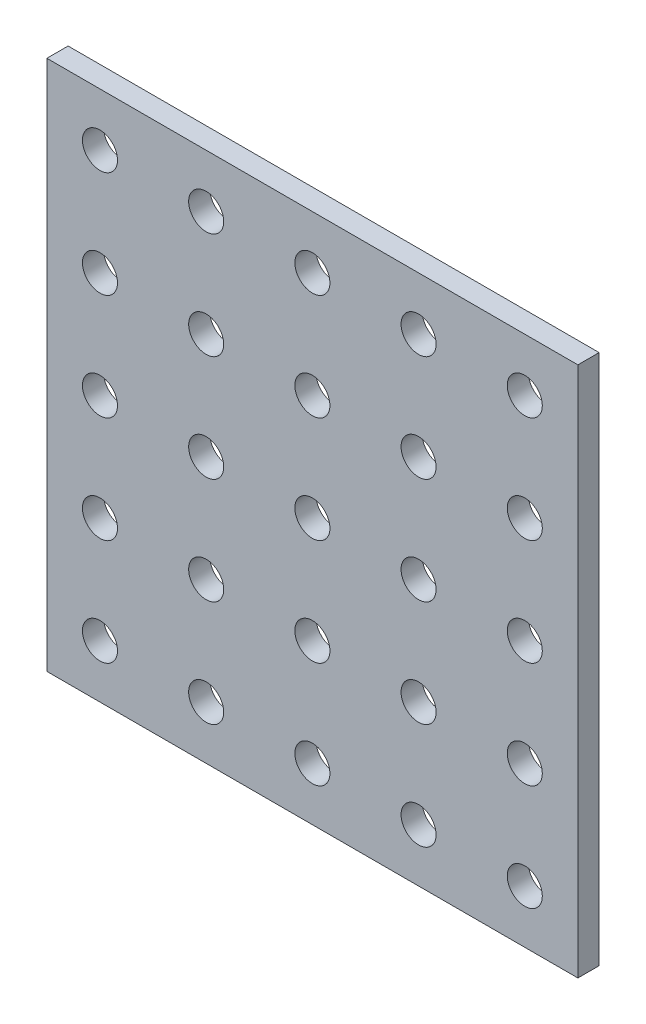
ISO-10303-21;
HEADER;
FILE_DESCRIPTION(('STEP AP214'),'2;1');
FILE_NAME('part.step','',(''),(''),'','','');
FILE_SCHEMA(('AUTOMOTIVE_DESIGN { 1 0 10303 214 1 1 1 1 }'));
ENDSEC;
DATA;
#1=APPLICATION_CONTEXT('core data for automotive mechanical design processes');
#2=APPLICATION_PROTOCOL_DEFINITION('international standard','automotive_design',2000,#1);
#3=PRODUCT_CONTEXT('',#1,'mechanical');
#4=PRODUCT('Part','Part','',(#3));
#5=PRODUCT_RELATED_PRODUCT_CATEGORY('part','',(#4));
#6=PRODUCT_DEFINITION_FORMATION('','',#4);
#7=PRODUCT_DEFINITION_CONTEXT('part definition',#1,'design');
#8=PRODUCT_DEFINITION('design','',#6,#7);
#9=PRODUCT_DEFINITION_SHAPE('','',#8);
#10=(LENGTH_UNIT() NAMED_UNIT(*) SI_UNIT(.MILLI.,.METRE.));
#11=(NAMED_UNIT(*) PLANE_ANGLE_UNIT() SI_UNIT($,.RADIAN.));
#12=(NAMED_UNIT(*) SI_UNIT($,.STERADIAN.) SOLID_ANGLE_UNIT());
#13=UNCERTAINTY_MEASURE_WITH_UNIT(LENGTH_MEASURE(1.E-05),#10,'distance_accuracy_value','');
#14=(GEOMETRIC_REPRESENTATION_CONTEXT(3) GLOBAL_UNCERTAINTY_ASSIGNED_CONTEXT((#13)) GLOBAL_UNIT_ASSIGNED_CONTEXT((#10,
#11,#12)) REPRESENTATION_CONTEXT('',''));
#15=CARTESIAN_POINT('',(0.,0.,0.));
#16=DIRECTION('',(0.,0.,1.));
#17=DIRECTION('',(1.,0.,0.));
#18=AXIS2_PLACEMENT_3D('',#15,#16,#17);
#19=CARTESIAN_POINT('',(20.,-20.,0.));
#20=DIRECTION('',(0.,0.,1.));
#21=DIRECTION('',(1.,0.,0.));
#22=AXIS2_PLACEMENT_3D('',#19,#20,#21);
#23=CYLINDRICAL_SURFACE('',#22,1.65);
#24=CARTESIAN_POINT('',(20.,-20.,0.));
#25=DIRECTION('',(0.,0.,1.));
#26=DIRECTION('',(1.,0.,0.));
#27=AXIS2_PLACEMENT_3D('',#24,#25,#26);
#28=CIRCLE('',#27,1.65);
#29=CARTESIAN_POINT('',(21.65,-20.,0.));
#30=VERTEX_POINT('',#29);
#31=EDGE_CURVE('E41',#30,#30,#28,.T.);
#32=ORIENTED_EDGE('',*,*,#31,.F.);
#33=EDGE_LOOP('',(#32));
#34=FACE_BOUND('',#33,.T.);
#35=CARTESIAN_POINT('',(20.,-20.,2.));
#36=DIRECTION('',(0.,0.,1.));
#37=DIRECTION('',(1.,0.,0.));
#38=AXIS2_PLACEMENT_3D('',#35,#36,#37);
#39=CIRCLE('',#38,1.65);
#40=CARTESIAN_POINT('',(21.65,-20.,2.));
#41=VERTEX_POINT('',#40);
#42=EDGE_CURVE('E11',#41,#41,#39,.T.);
#43=ORIENTED_EDGE('',*,*,#42,.T.);
#44=EDGE_LOOP('',(#43));
#45=FACE_BOUND('',#44,.T.);
#46=ADVANCED_FACE('F33',(#34,#45),#23,.F.);
#47=CARTESIAN_POINT('',(20.,-9.99999999999999,0.));
#48=DIRECTION('',(0.,0.,1.));
#49=DIRECTION('',(1.,0.,0.));
#50=AXIS2_PLACEMENT_3D('',#47,#48,#49);
#51=CYLINDRICAL_SURFACE('',#50,1.65);
#52=CARTESIAN_POINT('',(20.,-9.99999999999999,0.));
#53=DIRECTION('',(0.,0.,1.));
#54=DIRECTION('',(1.,0.,0.));
#55=AXIS2_PLACEMENT_3D('',#52,#53,#54);
#56=CIRCLE('',#55,1.65);
#57=CARTESIAN_POINT('',(21.65,-9.99999999999999,0.));
#58=VERTEX_POINT('',#57);
#59=EDGE_CURVE('E237',#58,#58,#56,.T.);
#60=ORIENTED_EDGE('',*,*,#59,.F.);
#61=EDGE_LOOP('',(#60));
#62=FACE_BOUND('',#61,.T.);
#63=CARTESIAN_POINT('',(20.,-9.99999999999999,2.));
#64=DIRECTION('',(0.,0.,1.));
#65=DIRECTION('',(1.,0.,0.));
#66=AXIS2_PLACEMENT_3D('',#63,#64,#65);
#67=CIRCLE('',#66,1.65);
#68=CARTESIAN_POINT('',(21.65,-9.99999999999999,2.));
#69=VERTEX_POINT('',#68);
#70=EDGE_CURVE('E240',#69,#69,#67,.T.);
#71=ORIENTED_EDGE('',*,*,#70,.T.);
#72=EDGE_LOOP('',(#71));
#73=FACE_BOUND('',#72,.T.);
#74=ADVANCED_FACE('F249',(#62,#73),#51,.F.);
#75=CARTESIAN_POINT('',(20.,0.,0.));
#76=DIRECTION('',(0.,0.,1.));
#77=DIRECTION('',(1.,0.,0.));
#78=AXIS2_PLACEMENT_3D('',#75,#76,#77);
#79=CYLINDRICAL_SURFACE('',#78,1.65);
#80=CARTESIAN_POINT('',(20.,0.,0.));
#81=DIRECTION('',(0.,0.,1.));
#82=DIRECTION('',(1.,0.,0.));
#83=AXIS2_PLACEMENT_3D('',#80,#81,#82);
#84=CIRCLE('',#83,1.65);
#85=CARTESIAN_POINT('',(21.65,0.,0.));
#86=VERTEX_POINT('',#85);
#87=EDGE_CURVE('E231',#86,#86,#84,.T.);
#88=ORIENTED_EDGE('',*,*,#87,.F.);
#89=EDGE_LOOP('',(#88));
#90=FACE_BOUND('',#89,.T.);
#91=CARTESIAN_POINT('',(20.,0.,2.));
#92=DIRECTION('',(0.,0.,1.));
#93=DIRECTION('',(1.,0.,0.));
#94=AXIS2_PLACEMENT_3D('',#91,#92,#93);
#95=CIRCLE('',#94,1.65);
#96=CARTESIAN_POINT('',(21.65,0.,2.));
#97=VERTEX_POINT('',#96);
#98=EDGE_CURVE('E234',#97,#97,#95,.T.);
#99=ORIENTED_EDGE('',*,*,#98,.T.);
#100=EDGE_LOOP('',(#99));
#101=FACE_BOUND('',#100,.T.);
#102=ADVANCED_FACE('F356',(#90,#101),#79,.F.);
#103=CARTESIAN_POINT('',(20.,10.,0.));
#104=DIRECTION('',(0.,0.,1.));
#105=DIRECTION('',(1.,0.,0.));
#106=AXIS2_PLACEMENT_3D('',#103,#104,#105);
#107=CYLINDRICAL_SURFACE('',#106,1.65);
#108=CARTESIAN_POINT('',(20.,10.,0.));
#109=DIRECTION('',(0.,0.,1.));
#110=DIRECTION('',(1.,0.,0.));
#111=AXIS2_PLACEMENT_3D('',#108,#109,#110);
#112=CIRCLE('',#111,1.65);
#113=CARTESIAN_POINT('',(21.65,10.,0.));
#114=VERTEX_POINT('',#113);
#115=EDGE_CURVE('E225',#114,#114,#112,.T.);
#116=ORIENTED_EDGE('',*,*,#115,.F.);
#117=EDGE_LOOP('',(#116));
#118=FACE_BOUND('',#117,.T.);
#119=CARTESIAN_POINT('',(20.,10.,2.));
#120=DIRECTION('',(0.,0.,1.));
#121=DIRECTION('',(1.,0.,0.));
#122=AXIS2_PLACEMENT_3D('',#119,#120,#121);
#123=CIRCLE('',#122,1.65);
#124=CARTESIAN_POINT('',(21.65,10.,2.));
#125=VERTEX_POINT('',#124);
#126=EDGE_CURVE('E228',#125,#125,#123,.T.);
#127=ORIENTED_EDGE('',*,*,#126,.T.);
#128=EDGE_LOOP('',(#127));
#129=FACE_BOUND('',#128,.T.);
#130=ADVANCED_FACE('F352',(#118,#129),#107,.F.);
#131=CARTESIAN_POINT('',(20.,20.,0.));
#132=DIRECTION('',(0.,0.,1.));
#133=DIRECTION('',(1.,0.,0.));
#134=AXIS2_PLACEMENT_3D('',#131,#132,#133);
#135=CYLINDRICAL_SURFACE('',#134,1.65);
#136=CARTESIAN_POINT('',(20.,20.,0.));
#137=DIRECTION('',(0.,0.,1.));
#138=DIRECTION('',(1.,0.,0.));
#139=AXIS2_PLACEMENT_3D('',#136,#137,#138);
#140=CIRCLE('',#139,1.65);
#141=CARTESIAN_POINT('',(21.65,20.,0.));
#142=VERTEX_POINT('',#141);
#143=EDGE_CURVE('E219',#142,#142,#140,.T.);
#144=ORIENTED_EDGE('',*,*,#143,.F.);
#145=EDGE_LOOP('',(#144));
#146=FACE_BOUND('',#145,.T.);
#147=CARTESIAN_POINT('',(20.,20.,2.));
#148=DIRECTION('',(0.,0.,1.));
#149=DIRECTION('',(1.,0.,0.));
#150=AXIS2_PLACEMENT_3D('',#147,#148,#149);
#151=CIRCLE('',#150,1.65);
#152=CARTESIAN_POINT('',(21.65,20.,2.));
#153=VERTEX_POINT('',#152);
#154=EDGE_CURVE('E222',#153,#153,#151,.T.);
#155=ORIENTED_EDGE('',*,*,#154,.T.);
#156=EDGE_LOOP('',(#155));
#157=FACE_BOUND('',#156,.T.);
#158=ADVANCED_FACE('F348',(#146,#157),#135,.F.);
#159=CARTESIAN_POINT('',(10.,-20.,0.));
#160=DIRECTION('',(0.,0.,1.));
#161=DIRECTION('',(1.,0.,0.));
#162=AXIS2_PLACEMENT_3D('',#159,#160,#161);
#163=CYLINDRICAL_SURFACE('',#162,1.65);
#164=CARTESIAN_POINT('',(10.,-20.,0.));
#165=DIRECTION('',(0.,0.,1.));
#166=DIRECTION('',(1.,0.,0.));
#167=AXIS2_PLACEMENT_3D('',#164,#165,#166);
#168=CIRCLE('',#167,1.65);
#169=CARTESIAN_POINT('',(11.65,-20.,0.));
#170=VERTEX_POINT('',#169);
#171=EDGE_CURVE('E213',#170,#170,#168,.T.);
#172=ORIENTED_EDGE('',*,*,#171,.F.);
#173=EDGE_LOOP('',(#172));
#174=FACE_BOUND('',#173,.T.);
#175=CARTESIAN_POINT('',(10.,-20.,2.));
#176=DIRECTION('',(0.,0.,1.));
#177=DIRECTION('',(1.,0.,0.));
#178=AXIS2_PLACEMENT_3D('',#175,#176,#177);
#179=CIRCLE('',#178,1.65);
#180=CARTESIAN_POINT('',(11.65,-20.,2.));
#181=VERTEX_POINT('',#180);
#182=EDGE_CURVE('E216',#181,#181,#179,.T.);
#183=ORIENTED_EDGE('',*,*,#182,.T.);
#184=EDGE_LOOP('',(#183));
#185=FACE_BOUND('',#184,.T.);
#186=ADVANCED_FACE('F344',(#174,#185),#163,.F.);
#187=CARTESIAN_POINT('',(10.,-9.99999999999999,0.));
#188=DIRECTION('',(0.,0.,1.));
#189=DIRECTION('',(1.,0.,0.));
#190=AXIS2_PLACEMENT_3D('',#187,#188,#189);
#191=CYLINDRICAL_SURFACE('',#190,1.65);
#192=CARTESIAN_POINT('',(10.,-9.99999999999999,0.));
#193=DIRECTION('',(0.,0.,1.));
#194=DIRECTION('',(1.,0.,0.));
#195=AXIS2_PLACEMENT_3D('',#192,#193,#194);
#196=CIRCLE('',#195,1.65);
#197=CARTESIAN_POINT('',(11.65,-9.99999999999999,0.));
#198=VERTEX_POINT('',#197);
#199=EDGE_CURVE('E207',#198,#198,#196,.T.);
#200=ORIENTED_EDGE('',*,*,#199,.F.);
#201=EDGE_LOOP('',(#200));
#202=FACE_BOUND('',#201,.T.);
#203=CARTESIAN_POINT('',(10.,-9.99999999999999,2.));
#204=DIRECTION('',(0.,0.,1.));
#205=DIRECTION('',(1.,0.,0.));
#206=AXIS2_PLACEMENT_3D('',#203,#204,#205);
#207=CIRCLE('',#206,1.65);
#208=CARTESIAN_POINT('',(11.65,-9.99999999999999,2.));
#209=VERTEX_POINT('',#208);
#210=EDGE_CURVE('E210',#209,#209,#207,.T.);
#211=ORIENTED_EDGE('',*,*,#210,.T.);
#212=EDGE_LOOP('',(#211));
#213=FACE_BOUND('',#212,.T.);
#214=ADVANCED_FACE('F340',(#202,#213),#191,.F.);
#215=CARTESIAN_POINT('',(10.,0.,0.));
#216=DIRECTION('',(0.,0.,1.));
#217=DIRECTION('',(1.,0.,0.));
#218=AXIS2_PLACEMENT_3D('',#215,#216,#217);
#219=CYLINDRICAL_SURFACE('',#218,1.65);
#220=CARTESIAN_POINT('',(10.,0.,0.));
#221=DIRECTION('',(0.,0.,1.));
#222=DIRECTION('',(1.,0.,0.));
#223=AXIS2_PLACEMENT_3D('',#220,#221,#222);
#224=CIRCLE('',#223,1.65);
#225=CARTESIAN_POINT('',(11.65,0.,0.));
#226=VERTEX_POINT('',#225);
#227=EDGE_CURVE('E201',#226,#226,#224,.T.);
#228=ORIENTED_EDGE('',*,*,#227,.F.);
#229=EDGE_LOOP('',(#228));
#230=FACE_BOUND('',#229,.T.);
#231=CARTESIAN_POINT('',(10.,0.,2.));
#232=DIRECTION('',(0.,0.,1.));
#233=DIRECTION('',(1.,0.,0.));
#234=AXIS2_PLACEMENT_3D('',#231,#232,#233);
#235=CIRCLE('',#234,1.65);
#236=CARTESIAN_POINT('',(11.65,0.,2.));
#237=VERTEX_POINT('',#236);
#238=EDGE_CURVE('E204',#237,#237,#235,.T.);
#239=ORIENTED_EDGE('',*,*,#238,.T.);
#240=EDGE_LOOP('',(#239));
#241=FACE_BOUND('',#240,.T.);
#242=ADVANCED_FACE('F336',(#230,#241),#219,.F.);
#243=CARTESIAN_POINT('',(10.,10.,0.));
#244=DIRECTION('',(0.,0.,1.));
#245=DIRECTION('',(1.,0.,0.));
#246=AXIS2_PLACEMENT_3D('',#243,#244,#245);
#247=CYLINDRICAL_SURFACE('',#246,1.65);
#248=CARTESIAN_POINT('',(10.,10.,0.));
#249=DIRECTION('',(0.,0.,1.));
#250=DIRECTION('',(1.,0.,0.));
#251=AXIS2_PLACEMENT_3D('',#248,#249,#250);
#252=CIRCLE('',#251,1.65);
#253=CARTESIAN_POINT('',(11.65,10.,0.));
#254=VERTEX_POINT('',#253);
#255=EDGE_CURVE('E195',#254,#254,#252,.T.);
#256=ORIENTED_EDGE('',*,*,#255,.F.);
#257=EDGE_LOOP('',(#256));
#258=FACE_BOUND('',#257,.T.);
#259=CARTESIAN_POINT('',(10.,10.,2.));
#260=DIRECTION('',(0.,0.,1.));
#261=DIRECTION('',(1.,0.,0.));
#262=AXIS2_PLACEMENT_3D('',#259,#260,#261);
#263=CIRCLE('',#262,1.65);
#264=CARTESIAN_POINT('',(11.65,10.,2.));
#265=VERTEX_POINT('',#264);
#266=EDGE_CURVE('E198',#265,#265,#263,.T.);
#267=ORIENTED_EDGE('',*,*,#266,.T.);
#268=EDGE_LOOP('',(#267));
#269=FACE_BOUND('',#268,.T.);
#270=ADVANCED_FACE('F332',(#258,#269),#247,.F.);
#271=CARTESIAN_POINT('',(10.,20.,0.));
#272=DIRECTION('',(0.,0.,1.));
#273=DIRECTION('',(1.,0.,0.));
#274=AXIS2_PLACEMENT_3D('',#271,#272,#273);
#275=CYLINDRICAL_SURFACE('',#274,1.65);
#276=CARTESIAN_POINT('',(10.,20.,0.));
#277=DIRECTION('',(0.,0.,1.));
#278=DIRECTION('',(1.,0.,0.));
#279=AXIS2_PLACEMENT_3D('',#276,#277,#278);
#280=CIRCLE('',#279,1.65);
#281=CARTESIAN_POINT('',(11.65,20.,0.));
#282=VERTEX_POINT('',#281);
#283=EDGE_CURVE('E189',#282,#282,#280,.T.);
#284=ORIENTED_EDGE('',*,*,#283,.F.);
#285=EDGE_LOOP('',(#284));
#286=FACE_BOUND('',#285,.T.);
#287=CARTESIAN_POINT('',(10.,20.,2.));
#288=DIRECTION('',(0.,0.,1.));
#289=DIRECTION('',(1.,0.,0.));
#290=AXIS2_PLACEMENT_3D('',#287,#288,#289);
#291=CIRCLE('',#290,1.65);
#292=CARTESIAN_POINT('',(11.65,20.,2.));
#293=VERTEX_POINT('',#292);
#294=EDGE_CURVE('E192',#293,#293,#291,.T.);
#295=ORIENTED_EDGE('',*,*,#294,.T.);
#296=EDGE_LOOP('',(#295));
#297=FACE_BOUND('',#296,.T.);
#298=ADVANCED_FACE('F328',(#286,#297),#275,.F.);
#299=CARTESIAN_POINT('',(0.,-20.,0.));
#300=DIRECTION('',(0.,0.,1.));
#301=DIRECTION('',(1.,0.,0.));
#302=AXIS2_PLACEMENT_3D('',#299,#300,#301);
#303=CYLINDRICAL_SURFACE('',#302,1.65);
#304=CARTESIAN_POINT('',(0.,-20.,0.));
#305=DIRECTION('',(0.,0.,1.));
#306=DIRECTION('',(1.,0.,0.));
#307=AXIS2_PLACEMENT_3D('',#304,#305,#306);
#308=CIRCLE('',#307,1.65);
#309=CARTESIAN_POINT('',(1.65,-20.,0.));
#310=VERTEX_POINT('',#309);
#311=EDGE_CURVE('E183',#310,#310,#308,.T.);
#312=ORIENTED_EDGE('',*,*,#311,.F.);
#313=EDGE_LOOP('',(#312));
#314=FACE_BOUND('',#313,.T.);
#315=CARTESIAN_POINT('',(0.,-20.,2.));
#316=DIRECTION('',(0.,0.,1.));
#317=DIRECTION('',(1.,0.,0.));
#318=AXIS2_PLACEMENT_3D('',#315,#316,#317);
#319=CIRCLE('',#318,1.65);
#320=CARTESIAN_POINT('',(1.65,-20.,2.));
#321=VERTEX_POINT('',#320);
#322=EDGE_CURVE('E186',#321,#321,#319,.T.);
#323=ORIENTED_EDGE('',*,*,#322,.T.);
#324=EDGE_LOOP('',(#323));
#325=FACE_BOUND('',#324,.T.);
#326=ADVANCED_FACE('F324',(#314,#325),#303,.F.);
#327=CARTESIAN_POINT('',(0.,-9.99999999999999,0.));
#328=DIRECTION('',(0.,0.,1.));
#329=DIRECTION('',(1.,0.,0.));
#330=AXIS2_PLACEMENT_3D('',#327,#328,#329);
#331=CYLINDRICAL_SURFACE('',#330,1.65);
#332=CARTESIAN_POINT('',(0.,-9.99999999999999,0.));
#333=DIRECTION('',(0.,0.,1.));
#334=DIRECTION('',(1.,0.,0.));
#335=AXIS2_PLACEMENT_3D('',#332,#333,#334);
#336=CIRCLE('',#335,1.65);
#337=CARTESIAN_POINT('',(1.65,-9.99999999999999,0.));
#338=VERTEX_POINT('',#337);
#339=EDGE_CURVE('E177',#338,#338,#336,.T.);
#340=ORIENTED_EDGE('',*,*,#339,.F.);
#341=EDGE_LOOP('',(#340));
#342=FACE_BOUND('',#341,.T.);
#343=CARTESIAN_POINT('',(0.,-9.99999999999999,2.));
#344=DIRECTION('',(0.,0.,1.));
#345=DIRECTION('',(1.,0.,0.));
#346=AXIS2_PLACEMENT_3D('',#343,#344,#345);
#347=CIRCLE('',#346,1.65);
#348=CARTESIAN_POINT('',(1.65,-9.99999999999999,2.));
#349=VERTEX_POINT('',#348);
#350=EDGE_CURVE('E180',#349,#349,#347,.T.);
#351=ORIENTED_EDGE('',*,*,#350,.T.);
#352=EDGE_LOOP('',(#351));
#353=FACE_BOUND('',#352,.T.);
#354=ADVANCED_FACE('F320',(#342,#353),#331,.F.);
#355=CARTESIAN_POINT('',(0.,0.,0.));
#356=DIRECTION('',(0.,0.,1.));
#357=DIRECTION('',(1.,0.,0.));
#358=AXIS2_PLACEMENT_3D('',#355,#356,#357);
#359=CYLINDRICAL_SURFACE('',#358,1.65);
#360=CARTESIAN_POINT('',(0.,0.,0.));
#361=DIRECTION('',(0.,0.,1.));
#362=DIRECTION('',(1.,0.,0.));
#363=AXIS2_PLACEMENT_3D('',#360,#361,#362);
#364=CIRCLE('',#363,1.65);
#365=CARTESIAN_POINT('',(1.65,0.,0.));
#366=VERTEX_POINT('',#365);
#367=EDGE_CURVE('E171',#366,#366,#364,.T.);
#368=ORIENTED_EDGE('',*,*,#367,.F.);
#369=EDGE_LOOP('',(#368));
#370=FACE_BOUND('',#369,.T.);
#371=CARTESIAN_POINT('',(0.,0.,2.));
#372=DIRECTION('',(0.,0.,1.));
#373=DIRECTION('',(1.,0.,0.));
#374=AXIS2_PLACEMENT_3D('',#371,#372,#373);
#375=CIRCLE('',#374,1.65);
#376=CARTESIAN_POINT('',(1.65,0.,2.));
#377=VERTEX_POINT('',#376);
#378=EDGE_CURVE('E174',#377,#377,#375,.T.);
#379=ORIENTED_EDGE('',*,*,#378,.T.);
#380=EDGE_LOOP('',(#379));
#381=FACE_BOUND('',#380,.T.);
#382=ADVANCED_FACE('F316',(#370,#381),#359,.F.);
#383=CARTESIAN_POINT('',(0.,10.,0.));
#384=DIRECTION('',(0.,0.,1.));
#385=DIRECTION('',(1.,0.,0.));
#386=AXIS2_PLACEMENT_3D('',#383,#384,#385);
#387=CYLINDRICAL_SURFACE('',#386,1.65);
#388=CARTESIAN_POINT('',(0.,10.,0.));
#389=DIRECTION('',(0.,0.,1.));
#390=DIRECTION('',(1.,0.,0.));
#391=AXIS2_PLACEMENT_3D('',#388,#389,#390);
#392=CIRCLE('',#391,1.65);
#393=CARTESIAN_POINT('',(1.65,10.,0.));
#394=VERTEX_POINT('',#393);
#395=EDGE_CURVE('E165',#394,#394,#392,.T.);
#396=ORIENTED_EDGE('',*,*,#395,.F.);
#397=EDGE_LOOP('',(#396));
#398=FACE_BOUND('',#397,.T.);
#399=CARTESIAN_POINT('',(0.,10.,2.));
#400=DIRECTION('',(0.,0.,1.));
#401=DIRECTION('',(1.,0.,0.));
#402=AXIS2_PLACEMENT_3D('',#399,#400,#401);
#403=CIRCLE('',#402,1.65);
#404=CARTESIAN_POINT('',(1.65,10.,2.));
#405=VERTEX_POINT('',#404);
#406=EDGE_CURVE('E168',#405,#405,#403,.T.);
#407=ORIENTED_EDGE('',*,*,#406,.T.);
#408=EDGE_LOOP('',(#407));
#409=FACE_BOUND('',#408,.T.);
#410=ADVANCED_FACE('F312',(#398,#409),#387,.F.);
#411=CARTESIAN_POINT('',(0.,20.,0.));
#412=DIRECTION('',(0.,0.,1.));
#413=DIRECTION('',(1.,0.,0.));
#414=AXIS2_PLACEMENT_3D('',#411,#412,#413);
#415=CYLINDRICAL_SURFACE('',#414,1.65);
#416=CARTESIAN_POINT('',(0.,20.,0.));
#417=DIRECTION('',(0.,0.,1.));
#418=DIRECTION('',(1.,0.,0.));
#419=AXIS2_PLACEMENT_3D('',#416,#417,#418);
#420=CIRCLE('',#419,1.65);
#421=CARTESIAN_POINT('',(1.65,20.,0.));
#422=VERTEX_POINT('',#421);
#423=EDGE_CURVE('E159',#422,#422,#420,.T.);
#424=ORIENTED_EDGE('',*,*,#423,.F.);
#425=EDGE_LOOP('',(#424));
#426=FACE_BOUND('',#425,.T.);
#427=CARTESIAN_POINT('',(0.,20.,2.));
#428=DIRECTION('',(0.,0.,1.));
#429=DIRECTION('',(1.,0.,0.));
#430=AXIS2_PLACEMENT_3D('',#427,#428,#429);
#431=CIRCLE('',#430,1.65);
#432=CARTESIAN_POINT('',(1.65,20.,2.));
#433=VERTEX_POINT('',#432);
#434=EDGE_CURVE('E162',#433,#433,#431,.T.);
#435=ORIENTED_EDGE('',*,*,#434,.T.);
#436=EDGE_LOOP('',(#435));
#437=FACE_BOUND('',#436,.T.);
#438=ADVANCED_FACE('F308',(#426,#437),#415,.F.);
#439=CARTESIAN_POINT('',(-10.,-20.,0.));
#440=DIRECTION('',(0.,0.,1.));
#441=DIRECTION('',(1.,0.,0.));
#442=AXIS2_PLACEMENT_3D('',#439,#440,#441);
#443=CYLINDRICAL_SURFACE('',#442,1.65);
#444=CARTESIAN_POINT('',(-10.,-20.,0.));
#445=DIRECTION('',(0.,0.,1.));
#446=DIRECTION('',(1.,0.,0.));
#447=AXIS2_PLACEMENT_3D('',#444,#445,#446);
#448=CIRCLE('',#447,1.65);
#449=CARTESIAN_POINT('',(-8.35,-20.,0.));
#450=VERTEX_POINT('',#449);
#451=EDGE_CURVE('E153',#450,#450,#448,.T.);
#452=ORIENTED_EDGE('',*,*,#451,.F.);
#453=EDGE_LOOP('',(#452));
#454=FACE_BOUND('',#453,.T.);
#455=CARTESIAN_POINT('',(-10.,-20.,2.));
#456=DIRECTION('',(0.,0.,1.));
#457=DIRECTION('',(1.,0.,0.));
#458=AXIS2_PLACEMENT_3D('',#455,#456,#457);
#459=CIRCLE('',#458,1.65);
#460=CARTESIAN_POINT('',(-8.35,-20.,2.));
#461=VERTEX_POINT('',#460);
#462=EDGE_CURVE('E156',#461,#461,#459,.T.);
#463=ORIENTED_EDGE('',*,*,#462,.T.);
#464=EDGE_LOOP('',(#463));
#465=FACE_BOUND('',#464,.T.);
#466=ADVANCED_FACE('F304',(#454,#465),#443,.F.);
#467=CARTESIAN_POINT('',(-10.,-9.99999999999999,0.));
#468=DIRECTION('',(0.,0.,1.));
#469=DIRECTION('',(1.,0.,0.));
#470=AXIS2_PLACEMENT_3D('',#467,#468,#469);
#471=CYLINDRICAL_SURFACE('',#470,1.65);
#472=CARTESIAN_POINT('',(-10.,-9.99999999999999,0.));
#473=DIRECTION('',(0.,0.,1.));
#474=DIRECTION('',(1.,0.,0.));
#475=AXIS2_PLACEMENT_3D('',#472,#473,#474);
#476=CIRCLE('',#475,1.65);
#477=CARTESIAN_POINT('',(-8.35,-9.99999999999999,0.));
#478=VERTEX_POINT('',#477);
#479=EDGE_CURVE('E147',#478,#478,#476,.T.);
#480=ORIENTED_EDGE('',*,*,#479,.F.);
#481=EDGE_LOOP('',(#480));
#482=FACE_BOUND('',#481,.T.);
#483=CARTESIAN_POINT('',(-10.,-9.99999999999999,2.));
#484=DIRECTION('',(0.,0.,1.));
#485=DIRECTION('',(1.,0.,0.));
#486=AXIS2_PLACEMENT_3D('',#483,#484,#485);
#487=CIRCLE('',#486,1.65);
#488=CARTESIAN_POINT('',(-8.35,-9.99999999999999,2.));
#489=VERTEX_POINT('',#488);
#490=EDGE_CURVE('E150',#489,#489,#487,.T.);
#491=ORIENTED_EDGE('',*,*,#490,.T.);
#492=EDGE_LOOP('',(#491));
#493=FACE_BOUND('',#492,.T.);
#494=ADVANCED_FACE('F300',(#482,#493),#471,.F.);
#495=CARTESIAN_POINT('',(-10.,0.,0.));
#496=DIRECTION('',(0.,0.,1.));
#497=DIRECTION('',(1.,0.,0.));
#498=AXIS2_PLACEMENT_3D('',#495,#496,#497);
#499=CYLINDRICAL_SURFACE('',#498,1.65);
#500=CARTESIAN_POINT('',(-10.,0.,0.));
#501=DIRECTION('',(0.,0.,1.));
#502=DIRECTION('',(1.,0.,0.));
#503=AXIS2_PLACEMENT_3D('',#500,#501,#502);
#504=CIRCLE('',#503,1.65);
#505=CARTESIAN_POINT('',(-8.35,0.,0.));
#506=VERTEX_POINT('',#505);
#507=EDGE_CURVE('E141',#506,#506,#504,.T.);
#508=ORIENTED_EDGE('',*,*,#507,.F.);
#509=EDGE_LOOP('',(#508));
#510=FACE_BOUND('',#509,.T.);
#511=CARTESIAN_POINT('',(-10.,0.,2.));
#512=DIRECTION('',(0.,0.,1.));
#513=DIRECTION('',(1.,0.,0.));
#514=AXIS2_PLACEMENT_3D('',#511,#512,#513);
#515=CIRCLE('',#514,1.65);
#516=CARTESIAN_POINT('',(-8.35,0.,2.));
#517=VERTEX_POINT('',#516);
#518=EDGE_CURVE('E144',#517,#517,#515,.T.);
#519=ORIENTED_EDGE('',*,*,#518,.T.);
#520=EDGE_LOOP('',(#519));
#521=FACE_BOUND('',#520,.T.);
#522=ADVANCED_FACE('F296',(#510,#521),#499,.F.);
#523=CARTESIAN_POINT('',(-10.,10.,0.));
#524=DIRECTION('',(0.,0.,1.));
#525=DIRECTION('',(1.,0.,0.));
#526=AXIS2_PLACEMENT_3D('',#523,#524,#525);
#527=CYLINDRICAL_SURFACE('',#526,1.65);
#528=CARTESIAN_POINT('',(-10.,10.,0.));
#529=DIRECTION('',(0.,0.,1.));
#530=DIRECTION('',(1.,0.,0.));
#531=AXIS2_PLACEMENT_3D('',#528,#529,#530);
#532=CIRCLE('',#531,1.65);
#533=CARTESIAN_POINT('',(-8.35,10.,0.));
#534=VERTEX_POINT('',#533);
#535=EDGE_CURVE('E135',#534,#534,#532,.T.);
#536=ORIENTED_EDGE('',*,*,#535,.F.);
#537=EDGE_LOOP('',(#536));
#538=FACE_BOUND('',#537,.T.);
#539=CARTESIAN_POINT('',(-10.,10.,2.));
#540=DIRECTION('',(0.,0.,1.));
#541=DIRECTION('',(1.,0.,0.));
#542=AXIS2_PLACEMENT_3D('',#539,#540,#541);
#543=CIRCLE('',#542,1.65);
#544=CARTESIAN_POINT('',(-8.35,10.,2.));
#545=VERTEX_POINT('',#544);
#546=EDGE_CURVE('E138',#545,#545,#543,.T.);
#547=ORIENTED_EDGE('',*,*,#546,.T.);
#548=EDGE_LOOP('',(#547));
#549=FACE_BOUND('',#548,.T.);
#550=ADVANCED_FACE('F292',(#538,#549),#527,.F.);
#551=CARTESIAN_POINT('',(-10.,20.,0.));
#552=DIRECTION('',(0.,0.,1.));
#553=DIRECTION('',(1.,0.,0.));
#554=AXIS2_PLACEMENT_3D('',#551,#552,#553);
#555=CYLINDRICAL_SURFACE('',#554,1.65);
#556=CARTESIAN_POINT('',(-10.,20.,0.));
#557=DIRECTION('',(0.,0.,1.));
#558=DIRECTION('',(1.,0.,0.));
#559=AXIS2_PLACEMENT_3D('',#556,#557,#558);
#560=CIRCLE('',#559,1.65);
#561=CARTESIAN_POINT('',(-8.35,20.,0.));
#562=VERTEX_POINT('',#561);
#563=EDGE_CURVE('E129',#562,#562,#560,.T.);
#564=ORIENTED_EDGE('',*,*,#563,.F.);
#565=EDGE_LOOP('',(#564));
#566=FACE_BOUND('',#565,.T.);
#567=CARTESIAN_POINT('',(-10.,20.,2.));
#568=DIRECTION('',(0.,0.,1.));
#569=DIRECTION('',(1.,0.,0.));
#570=AXIS2_PLACEMENT_3D('',#567,#568,#569);
#571=CIRCLE('',#570,1.65);
#572=CARTESIAN_POINT('',(-8.35,20.,2.));
#573=VERTEX_POINT('',#572);
#574=EDGE_CURVE('E132',#573,#573,#571,.T.);
#575=ORIENTED_EDGE('',*,*,#574,.T.);
#576=EDGE_LOOP('',(#575));
#577=FACE_BOUND('',#576,.T.);
#578=ADVANCED_FACE('F288',(#566,#577),#555,.F.);
#579=CARTESIAN_POINT('',(-20.,-20.,0.));
#580=DIRECTION('',(0.,0.,1.));
#581=DIRECTION('',(1.,0.,0.));
#582=AXIS2_PLACEMENT_3D('',#579,#580,#581);
#583=CYLINDRICAL_SURFACE('',#582,1.65);
#584=CARTESIAN_POINT('',(-20.,-20.,0.));
#585=DIRECTION('',(0.,0.,1.));
#586=DIRECTION('',(1.,0.,0.));
#587=AXIS2_PLACEMENT_3D('',#584,#585,#586);
#588=CIRCLE('',#587,1.65);
#589=CARTESIAN_POINT('',(-18.35,-20.,0.));
#590=VERTEX_POINT('',#589);
#591=EDGE_CURVE('E123',#590,#590,#588,.T.);
#592=ORIENTED_EDGE('',*,*,#591,.F.);
#593=EDGE_LOOP('',(#592));
#594=FACE_BOUND('',#593,.T.);
#595=CARTESIAN_POINT('',(-20.,-20.,2.));
#596=DIRECTION('',(0.,0.,1.));
#597=DIRECTION('',(1.,0.,0.));
#598=AXIS2_PLACEMENT_3D('',#595,#596,#597);
#599=CIRCLE('',#598,1.65);
#600=CARTESIAN_POINT('',(-18.35,-20.,2.));
#601=VERTEX_POINT('',#600);
#602=EDGE_CURVE('E126',#601,#601,#599,.T.);
#603=ORIENTED_EDGE('',*,*,#602,.T.);
#604=EDGE_LOOP('',(#603));
#605=FACE_BOUND('',#604,.T.);
#606=ADVANCED_FACE('F284',(#594,#605),#583,.F.);
#607=CARTESIAN_POINT('',(-20.,-9.99999999999999,0.));
#608=DIRECTION('',(0.,0.,1.));
#609=DIRECTION('',(1.,0.,0.));
#610=AXIS2_PLACEMENT_3D('',#607,#608,#609);
#611=CYLINDRICAL_SURFACE('',#610,1.65);
#612=CARTESIAN_POINT('',(-20.,-9.99999999999999,0.));
#613=DIRECTION('',(0.,0.,1.));
#614=DIRECTION('',(1.,0.,0.));
#615=AXIS2_PLACEMENT_3D('',#612,#613,#614);
#616=CIRCLE('',#615,1.65);
#617=CARTESIAN_POINT('',(-18.35,-9.99999999999999,0.));
#618=VERTEX_POINT('',#617);
#619=EDGE_CURVE('E117',#618,#618,#616,.T.);
#620=ORIENTED_EDGE('',*,*,#619,.F.);
#621=EDGE_LOOP('',(#620));
#622=FACE_BOUND('',#621,.T.);
#623=CARTESIAN_POINT('',(-20.,-9.99999999999999,2.));
#624=DIRECTION('',(0.,0.,1.));
#625=DIRECTION('',(1.,0.,0.));
#626=AXIS2_PLACEMENT_3D('',#623,#624,#625);
#627=CIRCLE('',#626,1.65);
#628=CARTESIAN_POINT('',(-18.35,-9.99999999999999,2.));
#629=VERTEX_POINT('',#628);
#630=EDGE_CURVE('E120',#629,#629,#627,.T.);
#631=ORIENTED_EDGE('',*,*,#630,.T.);
#632=EDGE_LOOP('',(#631));
#633=FACE_BOUND('',#632,.T.);
#634=ADVANCED_FACE('F280',(#622,#633),#611,.F.);
#635=CARTESIAN_POINT('',(-20.,0.,0.));
#636=DIRECTION('',(0.,0.,1.));
#637=DIRECTION('',(1.,0.,0.));
#638=AXIS2_PLACEMENT_3D('',#635,#636,#637);
#639=CYLINDRICAL_SURFACE('',#638,1.65);
#640=CARTESIAN_POINT('',(-20.,0.,0.));
#641=DIRECTION('',(0.,0.,1.));
#642=DIRECTION('',(1.,0.,0.));
#643=AXIS2_PLACEMENT_3D('',#640,#641,#642);
#644=CIRCLE('',#643,1.65);
#645=CARTESIAN_POINT('',(-18.35,0.,0.));
#646=VERTEX_POINT('',#645);
#647=EDGE_CURVE('E111',#646,#646,#644,.T.);
#648=ORIENTED_EDGE('',*,*,#647,.F.);
#649=EDGE_LOOP('',(#648));
#650=FACE_BOUND('',#649,.T.);
#651=CARTESIAN_POINT('',(-20.,0.,2.));
#652=DIRECTION('',(0.,0.,1.));
#653=DIRECTION('',(1.,0.,0.));
#654=AXIS2_PLACEMENT_3D('',#651,#652,#653);
#655=CIRCLE('',#654,1.65);
#656=CARTESIAN_POINT('',(-18.35,0.,2.));
#657=VERTEX_POINT('',#656);
#658=EDGE_CURVE('E114',#657,#657,#655,.T.);
#659=ORIENTED_EDGE('',*,*,#658,.T.);
#660=EDGE_LOOP('',(#659));
#661=FACE_BOUND('',#660,.T.);
#662=ADVANCED_FACE('F276',(#650,#661),#639,.F.);
#663=CARTESIAN_POINT('',(25.,-25.,2.));
#664=DIRECTION('',(-1.,0.,0.));
#665=DIRECTION('',(0.,0.,1.));
#666=AXIS2_PLACEMENT_3D('',#663,#664,#665);
#667=PLANE('',#666);
#668=DIRECTION('',(0.,1.,0.));
#669=VECTOR('',#668,1.);
#670=CARTESIAN_POINT('',(25.,-25.,0.));
#671=LINE('',#670,#669);
#672=CARTESIAN_POINT('',(25.,-25.,0.));
#673=VERTEX_POINT('',#672);
#674=CARTESIAN_POINT('',(25.,25.,0.));
#675=VERTEX_POINT('',#674);
#676=EDGE_CURVE('E101',#673,#675,#671,.T.);
#677=ORIENTED_EDGE('',*,*,#676,.T.);
#678=DIRECTION('',(0.,0.,-1.));
#679=VECTOR('',#678,1.);
#680=CARTESIAN_POINT('',(25.,25.,2.));
#681=LINE('',#680,#679);
#682=CARTESIAN_POINT('',(25.,25.,2.));
#683=VERTEX_POINT('',#682);
#684=EDGE_CURVE('E92',#683,#675,#681,.T.);
#685=ORIENTED_EDGE('',*,*,#684,.F.);
#686=DIRECTION('',(0.,1.,0.));
#687=VECTOR('',#686,1.);
#688=CARTESIAN_POINT('',(25.,-25.,2.));
#689=LINE('',#688,#687);
#690=CARTESIAN_POINT('',(25.,-25.,2.));
#691=VERTEX_POINT('',#690);
#692=EDGE_CURVE('E86',#691,#683,#689,.T.);
#693=ORIENTED_EDGE('',*,*,#692,.F.);
#694=DIRECTION('',(0.,0.,-1.));
#695=VECTOR('',#694,1.);
#696=CARTESIAN_POINT('',(25.,-25.,2.));
#697=LINE('',#696,#695);
#698=EDGE_CURVE('E97',#691,#673,#697,.T.);
#699=ORIENTED_EDGE('',*,*,#698,.T.);
#700=EDGE_LOOP('',(#677,#685,#693,#699));
#701=FACE_BOUND('',#700,.T.);
#702=ADVANCED_FACE('F273',(#701),#667,.F.);
#703=CARTESIAN_POINT('',(-25.,25.,2.));
#704=DIRECTION('',(0.,-1.,0.));
#705=DIRECTION('',(0.,0.,-1.));
#706=AXIS2_PLACEMENT_3D('',#703,#704,#705);
#707=PLANE('',#706);
#708=DIRECTION('',(-1.,0.,0.));
#709=VECTOR('',#708,1.);
#710=CARTESIAN_POINT('',(-25.,25.,0.));
#711=LINE('',#710,#709);
#712=CARTESIAN_POINT('',(-25.,25.,0.));
#713=VERTEX_POINT('',#712);
#714=EDGE_CURVE('E91',#675,#713,#711,.T.);
#715=ORIENTED_EDGE('',*,*,#714,.T.);
#716=DIRECTION('',(0.,0.,-1.));
#717=VECTOR('',#716,1.);
#718=CARTESIAN_POINT('',(-25.,25.,2.));
#719=LINE('',#718,#717);
#720=CARTESIAN_POINT('',(-25.,25.,2.));
#721=VERTEX_POINT('',#720);
#722=EDGE_CURVE('E89',#721,#713,#719,.T.);
#723=ORIENTED_EDGE('',*,*,#722,.F.);
#724=DIRECTION('',(-1.,0.,0.));
#725=VECTOR('',#724,1.);
#726=CARTESIAN_POINT('',(-25.,25.,2.));
#727=LINE('',#726,#725);
#728=EDGE_CURVE('E80',#683,#721,#727,.T.);
#729=ORIENTED_EDGE('',*,*,#728,.F.);
#730=ORIENTED_EDGE('',*,*,#684,.T.);
#731=EDGE_LOOP('',(#715,#723,#729,#730));
#732=FACE_BOUND('',#731,.T.);
#733=ADVANCED_FACE('F90',(#732),#707,.F.);
#734=CARTESIAN_POINT('',(-25.,-25.,2.));
#735=DIRECTION('',(1.,0.,0.));
#736=DIRECTION('',(0.,0.,-1.));
#737=AXIS2_PLACEMENT_3D('',#734,#735,#736);
#738=PLANE('',#737);
#739=DIRECTION('',(0.,-1.,0.));
#740=VECTOR('',#739,1.);
#741=CARTESIAN_POINT('',(-25.,-25.,0.));
#742=LINE('',#741,#740);
#743=CARTESIAN_POINT('',(-25.,-25.,0.));
#744=VERTEX_POINT('',#743);
#745=EDGE_CURVE('E66',#713,#744,#742,.T.);
#746=ORIENTED_EDGE('',*,*,#745,.T.);
#747=DIRECTION('',(0.,0.,-1.));
#748=VECTOR('',#747,1.);
#749=CARTESIAN_POINT('',(-25.,-25.,2.));
#750=LINE('',#749,#748);
#751=CARTESIAN_POINT('',(-25.,-25.,2.));
#752=VERTEX_POINT('',#751);
#753=EDGE_CURVE('E93',#752,#744,#750,.T.);
#754=ORIENTED_EDGE('',*,*,#753,.F.);
#755=DIRECTION('',(0.,-1.,0.));
#756=VECTOR('',#755,1.);
#757=CARTESIAN_POINT('',(-25.,-25.,2.));
#758=LINE('',#757,#756);
#759=EDGE_CURVE('E84',#721,#752,#758,.T.);
#760=ORIENTED_EDGE('',*,*,#759,.F.);
#761=ORIENTED_EDGE('',*,*,#722,.T.);
#762=EDGE_LOOP('',(#746,#754,#760,#761));
#763=FACE_BOUND('',#762,.T.);
#764=ADVANCED_FACE('F95',(#763),#738,.F.);
#765=CARTESIAN_POINT('',(-25.,-25.,2.));
#766=DIRECTION('',(0.,1.,0.));
#767=DIRECTION('',(0.,0.,1.));
#768=AXIS2_PLACEMENT_3D('',#765,#766,#767);
#769=PLANE('',#768);
#770=DIRECTION('',(1.,0.,0.));
#771=VECTOR('',#770,1.);
#772=CARTESIAN_POINT('',(-25.,-25.,0.));
#773=LINE('',#772,#771);
#774=EDGE_CURVE('E72',#744,#673,#773,.T.);
#775=ORIENTED_EDGE('',*,*,#774,.T.);
#776=ORIENTED_EDGE('',*,*,#698,.F.);
#777=DIRECTION('',(1.,0.,0.));
#778=VECTOR('',#777,1.);
#779=CARTESIAN_POINT('',(-25.,-25.,2.));
#780=LINE('',#779,#778);
#781=EDGE_CURVE('E49',#752,#691,#780,.T.);
#782=ORIENTED_EDGE('',*,*,#781,.F.);
#783=ORIENTED_EDGE('',*,*,#753,.T.);
#784=EDGE_LOOP('',(#775,#776,#782,#783));
#785=FACE_BOUND('',#784,.T.);
#786=ADVANCED_FACE('F253',(#785),#769,.F.);
#787=CARTESIAN_POINT('',(0.,0.,2.));
#788=DIRECTION('',(0.,0.,-1.));
#789=DIRECTION('',(-1.,0.,0.));
#790=AXIS2_PLACEMENT_3D('',#787,#788,#789);
#791=PLANE('',#790);
#792=CARTESIAN_POINT('',(-20.,10.,2.));
#793=DIRECTION('',(0.,0.,1.));
#794=DIRECTION('',(1.,0.,0.));
#795=AXIS2_PLACEMENT_3D('',#792,#793,#794);
#796=CIRCLE('',#795,1.65);
#797=CARTESIAN_POINT('',(-18.35,10.,2.));
#798=VERTEX_POINT('',#797);
#799=EDGE_CURVE('E555',#798,#798,#796,.T.);
#800=ORIENTED_EDGE('',*,*,#799,.F.);
#801=EDGE_LOOP('',(#800));
#802=FACE_BOUND('',#801,.T.);
#803=CARTESIAN_POINT('',(-20.,20.,2.));
#804=DIRECTION('',(0.,0.,1.));
#805=DIRECTION('',(1.,0.,0.));
#806=AXIS2_PLACEMENT_3D('',#803,#804,#805);
#807=CIRCLE('',#806,1.65);
#808=CARTESIAN_POINT('',(-18.35,20.,2.));
#809=VERTEX_POINT('',#808);
#810=EDGE_CURVE('E556',#809,#809,#807,.T.);
#811=ORIENTED_EDGE('',*,*,#810,.F.);
#812=EDGE_LOOP('',(#811));
#813=FACE_BOUND('',#812,.T.);
#814=ORIENTED_EDGE('',*,*,#692,.T.);
#815=ORIENTED_EDGE('',*,*,#728,.T.);
#816=ORIENTED_EDGE('',*,*,#759,.T.);
#817=ORIENTED_EDGE('',*,*,#781,.T.);
#818=EDGE_LOOP('',(#814,#815,#816,#817));
#819=FACE_BOUND('',#818,.T.);
#820=ORIENTED_EDGE('',*,*,#658,.F.);
#821=EDGE_LOOP('',(#820));
#822=FACE_BOUND('',#821,.T.);
#823=ORIENTED_EDGE('',*,*,#630,.F.);
#824=EDGE_LOOP('',(#823));
#825=FACE_BOUND('',#824,.T.);
#826=ORIENTED_EDGE('',*,*,#602,.F.);
#827=EDGE_LOOP('',(#826));
#828=FACE_BOUND('',#827,.T.);
#829=ORIENTED_EDGE('',*,*,#574,.F.);
#830=EDGE_LOOP('',(#829));
#831=FACE_BOUND('',#830,.T.);
#832=ORIENTED_EDGE('',*,*,#546,.F.);
#833=EDGE_LOOP('',(#832));
#834=FACE_BOUND('',#833,.T.);
#835=ORIENTED_EDGE('',*,*,#518,.F.);
#836=EDGE_LOOP('',(#835));
#837=FACE_BOUND('',#836,.T.);
#838=ORIENTED_EDGE('',*,*,#490,.F.);
#839=EDGE_LOOP('',(#838));
#840=FACE_BOUND('',#839,.T.);
#841=ORIENTED_EDGE('',*,*,#462,.F.);
#842=EDGE_LOOP('',(#841));
#843=FACE_BOUND('',#842,.T.);
#844=ORIENTED_EDGE('',*,*,#434,.F.);
#845=EDGE_LOOP('',(#844));
#846=FACE_BOUND('',#845,.T.);
#847=ORIENTED_EDGE('',*,*,#406,.F.);
#848=EDGE_LOOP('',(#847));
#849=FACE_BOUND('',#848,.T.);
#850=ORIENTED_EDGE('',*,*,#378,.F.);
#851=EDGE_LOOP('',(#850));
#852=FACE_BOUND('',#851,.T.);
#853=ORIENTED_EDGE('',*,*,#350,.F.);
#854=EDGE_LOOP('',(#853));
#855=FACE_BOUND('',#854,.T.);
#856=ORIENTED_EDGE('',*,*,#322,.F.);
#857=EDGE_LOOP('',(#856));
#858=FACE_BOUND('',#857,.T.);
#859=ORIENTED_EDGE('',*,*,#294,.F.);
#860=EDGE_LOOP('',(#859));
#861=FACE_BOUND('',#860,.T.);
#862=ORIENTED_EDGE('',*,*,#266,.F.);
#863=EDGE_LOOP('',(#862));
#864=FACE_BOUND('',#863,.T.);
#865=ORIENTED_EDGE('',*,*,#238,.F.);
#866=EDGE_LOOP('',(#865));
#867=FACE_BOUND('',#866,.T.);
#868=ORIENTED_EDGE('',*,*,#210,.F.);
#869=EDGE_LOOP('',(#868));
#870=FACE_BOUND('',#869,.T.);
#871=ORIENTED_EDGE('',*,*,#182,.F.);
#872=EDGE_LOOP('',(#871));
#873=FACE_BOUND('',#872,.T.);
#874=ORIENTED_EDGE('',*,*,#154,.F.);
#875=EDGE_LOOP('',(#874));
#876=FACE_BOUND('',#875,.T.);
#877=ORIENTED_EDGE('',*,*,#126,.F.);
#878=EDGE_LOOP('',(#877));
#879=FACE_BOUND('',#878,.T.);
#880=ORIENTED_EDGE('',*,*,#98,.F.);
#881=EDGE_LOOP('',(#880));
#882=FACE_BOUND('',#881,.T.);
#883=ORIENTED_EDGE('',*,*,#70,.F.);
#884=EDGE_LOOP('',(#883));
#885=FACE_BOUND('',#884,.T.);
#886=ORIENTED_EDGE('',*,*,#42,.F.);
#887=EDGE_LOOP('',(#886));
#888=FACE_BOUND('',#887,.T.);
#889=ADVANCED_FACE('F81',(#802,#813,#819,#822,#825,#828,#831,#834,#837,#840,#843,#846,#849,#852,
#855,#858,#861,#864,#867,#870,#873,#876,#879,#882,#885,#888),#791,.F.);
#890=CARTESIAN_POINT('',(0.,0.,0.));
#891=DIRECTION('',(0.,0.,-1.));
#892=DIRECTION('',(-1.,0.,0.));
#893=AXIS2_PLACEMENT_3D('',#890,#891,#892);
#894=PLANE('',#893);
#895=CARTESIAN_POINT('',(-20.,10.,0.));
#896=DIRECTION('',(0.,0.,1.));
#897=DIRECTION('',(1.,0.,0.));
#898=AXIS2_PLACEMENT_3D('',#895,#896,#897);
#899=CIRCLE('',#898,1.65);
#900=CARTESIAN_POINT('',(-18.35,10.,0.));
#901=VERTEX_POINT('',#900);
#902=EDGE_CURVE('E553',#901,#901,#899,.T.);
#903=ORIENTED_EDGE('',*,*,#902,.T.);
#904=EDGE_LOOP('',(#903));
#905=FACE_BOUND('',#904,.T.);
#906=CARTESIAN_POINT('',(-20.,20.,0.));
#907=DIRECTION('',(0.,0.,1.));
#908=DIRECTION('',(1.,0.,0.));
#909=AXIS2_PLACEMENT_3D('',#906,#907,#908);
#910=CIRCLE('',#909,1.65);
#911=CARTESIAN_POINT('',(-18.35,20.,0.));
#912=VERTEX_POINT('',#911);
#913=EDGE_CURVE('E104',#912,#912,#910,.T.);
#914=ORIENTED_EDGE('',*,*,#913,.T.);
#915=EDGE_LOOP('',(#914));
#916=FACE_BOUND('',#915,.T.);
#917=ORIENTED_EDGE('',*,*,#676,.F.);
#918=ORIENTED_EDGE('',*,*,#774,.F.);
#919=ORIENTED_EDGE('',*,*,#745,.F.);
#920=ORIENTED_EDGE('',*,*,#714,.F.);
#921=EDGE_LOOP('',(#917,#918,#919,#920));
#922=FACE_BOUND('',#921,.T.);
#923=ORIENTED_EDGE('',*,*,#647,.T.);
#924=EDGE_LOOP('',(#923));
#925=FACE_BOUND('',#924,.T.);
#926=ORIENTED_EDGE('',*,*,#619,.T.);
#927=EDGE_LOOP('',(#926));
#928=FACE_BOUND('',#927,.T.);
#929=ORIENTED_EDGE('',*,*,#591,.T.);
#930=EDGE_LOOP('',(#929));
#931=FACE_BOUND('',#930,.T.);
#932=ORIENTED_EDGE('',*,*,#563,.T.);
#933=EDGE_LOOP('',(#932));
#934=FACE_BOUND('',#933,.T.);
#935=ORIENTED_EDGE('',*,*,#535,.T.);
#936=EDGE_LOOP('',(#935));
#937=FACE_BOUND('',#936,.T.);
#938=ORIENTED_EDGE('',*,*,#507,.T.);
#939=EDGE_LOOP('',(#938));
#940=FACE_BOUND('',#939,.T.);
#941=ORIENTED_EDGE('',*,*,#479,.T.);
#942=EDGE_LOOP('',(#941));
#943=FACE_BOUND('',#942,.T.);
#944=ORIENTED_EDGE('',*,*,#451,.T.);
#945=EDGE_LOOP('',(#944));
#946=FACE_BOUND('',#945,.T.);
#947=ORIENTED_EDGE('',*,*,#423,.T.);
#948=EDGE_LOOP('',(#947));
#949=FACE_BOUND('',#948,.T.);
#950=ORIENTED_EDGE('',*,*,#395,.T.);
#951=EDGE_LOOP('',(#950));
#952=FACE_BOUND('',#951,.T.);
#953=ORIENTED_EDGE('',*,*,#367,.T.);
#954=EDGE_LOOP('',(#953));
#955=FACE_BOUND('',#954,.T.);
#956=ORIENTED_EDGE('',*,*,#339,.T.);
#957=EDGE_LOOP('',(#956));
#958=FACE_BOUND('',#957,.T.);
#959=ORIENTED_EDGE('',*,*,#311,.T.);
#960=EDGE_LOOP('',(#959));
#961=FACE_BOUND('',#960,.T.);
#962=ORIENTED_EDGE('',*,*,#283,.T.);
#963=EDGE_LOOP('',(#962));
#964=FACE_BOUND('',#963,.T.);
#965=ORIENTED_EDGE('',*,*,#255,.T.);
#966=EDGE_LOOP('',(#965));
#967=FACE_BOUND('',#966,.T.);
#968=ORIENTED_EDGE('',*,*,#227,.T.);
#969=EDGE_LOOP('',(#968));
#970=FACE_BOUND('',#969,.T.);
#971=ORIENTED_EDGE('',*,*,#199,.T.);
#972=EDGE_LOOP('',(#971));
#973=FACE_BOUND('',#972,.T.);
#974=ORIENTED_EDGE('',*,*,#171,.T.);
#975=EDGE_LOOP('',(#974));
#976=FACE_BOUND('',#975,.T.);
#977=ORIENTED_EDGE('',*,*,#143,.T.);
#978=EDGE_LOOP('',(#977));
#979=FACE_BOUND('',#978,.T.);
#980=ORIENTED_EDGE('',*,*,#115,.T.);
#981=EDGE_LOOP('',(#980));
#982=FACE_BOUND('',#981,.T.);
#983=ORIENTED_EDGE('',*,*,#87,.T.);
#984=EDGE_LOOP('',(#983));
#985=FACE_BOUND('',#984,.T.);
#986=ORIENTED_EDGE('',*,*,#59,.T.);
#987=EDGE_LOOP('',(#986));
#988=FACE_BOUND('',#987,.T.);
#989=ORIENTED_EDGE('',*,*,#31,.T.);
#990=EDGE_LOOP('',(#989));
#991=FACE_BOUND('',#990,.T.);
#992=ADVANCED_FACE('F245',(#905,#916,#922,#925,#928,#931,#934,#937,#940,#943,#946,#949,#952,
#955,#958,#961,#964,#967,#970,#973,#976,#979,#982,#985,#988,#991),#894,.T.);
#993=CARTESIAN_POINT('',(-20.,20.,0.));
#994=DIRECTION('',(0.,0.,1.));
#995=DIRECTION('',(1.,0.,0.));
#996=AXIS2_PLACEMENT_3D('',#993,#994,#995);
#997=CYLINDRICAL_SURFACE('',#996,1.65);
#998=ORIENTED_EDGE('',*,*,#913,.F.);
#999=EDGE_LOOP('',(#998));
#1000=FACE_BOUND('',#999,.T.);
#1001=ORIENTED_EDGE('',*,*,#810,.T.);
#1002=EDGE_LOOP('',(#1001));
#1003=FACE_BOUND('',#1002,.T.);
#1004=ADVANCED_FACE('F260',(#1000,#1003),#997,.F.);
#1005=CARTESIAN_POINT('',(-20.,10.,0.));
#1006=DIRECTION('',(0.,0.,1.));
#1007=DIRECTION('',(1.,0.,0.));
#1008=AXIS2_PLACEMENT_3D('',#1005,#1006,#1007);
#1009=CYLINDRICAL_SURFACE('',#1008,1.65);
#1010=ORIENTED_EDGE('',*,*,#902,.F.);
#1011=EDGE_LOOP('',(#1010));
#1012=FACE_BOUND('',#1011,.T.);
#1013=ORIENTED_EDGE('',*,*,#799,.T.);
#1014=EDGE_LOOP('',(#1013));
#1015=FACE_BOUND('',#1014,.T.);
#1016=ADVANCED_FACE('F480',(#1012,#1015),#1009,.F.);
#1017=CLOSED_SHELL('',(#46,#74,#102,#130,#158,#186,#214,#242,#270,#298,#326,#354,#382,#410,#438,
#466,#494,#522,#550,#578,#606,#634,#662,#702,#733,#764,#786,#889,#992,#1004,#1016));
#1018=MANIFOLD_SOLID_BREP('B2',#1017);
#1019=ADVANCED_BREP_SHAPE_REPRESENTATION('',(#18,#1018),#14);
#1020=SHAPE_DEFINITION_REPRESENTATION(#9,#1019);
ENDSEC;
END-ISO-10303-21;
